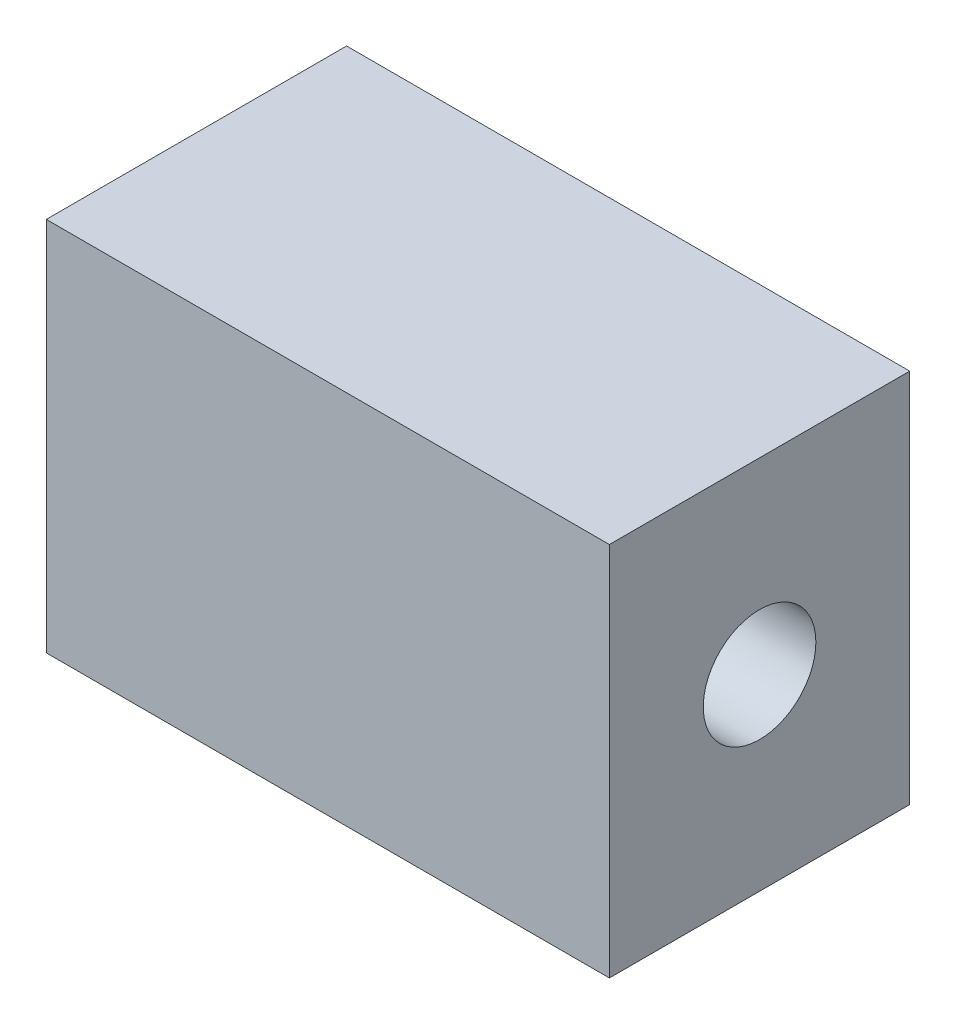
ISO-10303-21;
HEADER;
FILE_DESCRIPTION(('STEP AP214'),'2;1');
FILE_NAME('part.step','',(''),(''),'','','');
FILE_SCHEMA(('AUTOMOTIVE_DESIGN { 1 0 10303 214 1 1 1 1 }'));
ENDSEC;
DATA;
#1=APPLICATION_CONTEXT('core data for automotive mechanical design processes');
#2=APPLICATION_PROTOCOL_DEFINITION('international standard','automotive_design',2000,#1);
#3=PRODUCT_CONTEXT('',#1,'mechanical');
#4=PRODUCT('Part','Part','',(#3));
#5=PRODUCT_RELATED_PRODUCT_CATEGORY('part','',(#4));
#6=PRODUCT_DEFINITION_FORMATION('','',#4);
#7=PRODUCT_DEFINITION_CONTEXT('part definition',#1,'design');
#8=PRODUCT_DEFINITION('design','',#6,#7);
#9=PRODUCT_DEFINITION_SHAPE('','',#8);
#10=(LENGTH_UNIT() NAMED_UNIT(*) SI_UNIT(.MILLI.,.METRE.));
#11=(NAMED_UNIT(*) PLANE_ANGLE_UNIT() SI_UNIT($,.RADIAN.));
#12=(NAMED_UNIT(*) SI_UNIT($,.STERADIAN.) SOLID_ANGLE_UNIT());
#13=UNCERTAINTY_MEASURE_WITH_UNIT(LENGTH_MEASURE(1.E-05),#10,'distance_accuracy_value','');
#14=(GEOMETRIC_REPRESENTATION_CONTEXT(3) GLOBAL_UNCERTAINTY_ASSIGNED_CONTEXT((#13)) GLOBAL_UNIT_ASSIGNED_CONTEXT((#10,
#11,#12)) REPRESENTATION_CONTEXT('',''));
#15=CARTESIAN_POINT('',(0.,0.,0.));
#16=DIRECTION('',(0.,0.,1.));
#17=DIRECTION('',(1.,0.,0.));
#18=AXIS2_PLACEMENT_3D('',#15,#16,#17);
#19=CARTESIAN_POINT('',(-11.6375545851528,-0.502183406113536,8.));
#20=DIRECTION('',(0.,1.,0.));
#21=DIRECTION('',(0.,0.,1.));
#22=AXIS2_PLACEMENT_3D('',#19,#20,#21);
#23=PLANE('',#22);
#24=DIRECTION('',(1.,0.,0.));
#25=VECTOR('',#24,1.);
#26=CARTESIAN_POINT('',(-11.6375545851528,-0.502183406113536,0.));
#27=LINE('',#26,#25);
#28=CARTESIAN_POINT('',(-11.6375545851528,-0.502183406113536,0.));
#29=VERTEX_POINT('',#28);
#30=CARTESIAN_POINT('',(3.36244541484716,-0.502183406113536,0.));
#31=VERTEX_POINT('',#30);
#32=EDGE_CURVE('E97',#29,#31,#27,.T.);
#33=ORIENTED_EDGE('',*,*,#32,.T.);
#34=DIRECTION('',(0.,0.,-1.));
#35=VECTOR('',#34,1.);
#36=CARTESIAN_POINT('',(3.36244541484716,-0.502183406113536,8.));
#37=LINE('',#36,#35);
#38=CARTESIAN_POINT('',(3.36244541484716,-0.502183406113536,8.));
#39=VERTEX_POINT('',#38);
#40=EDGE_CURVE('E11',#39,#31,#37,.T.);
#41=ORIENTED_EDGE('',*,*,#40,.F.);
#42=DIRECTION('',(1.,0.,0.));
#43=VECTOR('',#42,1.);
#44=CARTESIAN_POINT('',(-11.6375545851528,-0.502183406113536,8.));
#45=LINE('',#44,#43);
#46=CARTESIAN_POINT('',(-11.6375545851528,-0.502183406113536,8.));
#47=VERTEX_POINT('',#46);
#48=EDGE_CURVE('E74',#47,#39,#45,.T.);
#49=ORIENTED_EDGE('',*,*,#48,.F.);
#50=DIRECTION('',(0.,0.,-1.));
#51=VECTOR('',#50,1.);
#52=CARTESIAN_POINT('',(-11.6375545851528,-0.502183406113536,8.));
#53=LINE('',#52,#51);
#54=EDGE_CURVE('E93',#47,#29,#53,.T.);
#55=ORIENTED_EDGE('',*,*,#54,.T.);
#56=EDGE_LOOP('',(#33,#41,#49,#55));
#57=FACE_BOUND('',#56,.T.);
#58=ADVANCED_FACE('F35',(#57),#23,.F.);
#59=CARTESIAN_POINT('',(3.36244541484716,9.49781659388646,8.));
#60=DIRECTION('',(1.,0.,0.));
#61=DIRECTION('',(0.,0.,-1.));
#62=AXIS2_PLACEMENT_3D('',#59,#60,#61);
#63=PLANE('',#62);
#64=CARTESIAN_POINT('',(3.36244541484716,4.49781659388646,4.));
#65=DIRECTION('',(1.,0.,0.));
#66=DIRECTION('',(0.,0.,-1.));
#67=AXIS2_PLACEMENT_3D('',#64,#65,#66);
#68=CIRCLE('',#67,1.5);
#69=CARTESIAN_POINT('',(3.36244541484716,4.49781659388646,2.5));
#70=VERTEX_POINT('',#69);
#71=EDGE_CURVE('E138',#70,#70,#68,.T.);
#72=ORIENTED_EDGE('',*,*,#71,.F.);
#73=EDGE_LOOP('',(#72));
#74=FACE_BOUND('',#73,.T.);
#75=DIRECTION('',(0.,-1.,0.));
#76=VECTOR('',#75,1.);
#77=CARTESIAN_POINT('',(3.36244541484716,9.49781659388646,0.));
#78=LINE('',#77,#76);
#79=CARTESIAN_POINT('',(3.36244541484716,9.49781659388646,0.));
#80=VERTEX_POINT('',#79);
#81=EDGE_CURVE('E83',#80,#31,#78,.T.);
#82=ORIENTED_EDGE('',*,*,#81,.F.);
#83=DIRECTION('',(0.,0.,-1.));
#84=VECTOR('',#83,1.);
#85=CARTESIAN_POINT('',(3.36244541484716,9.49781659388646,8.));
#86=LINE('',#85,#84);
#87=CARTESIAN_POINT('',(3.36244541484716,9.49781659388646,8.));
#88=VERTEX_POINT('',#87);
#89=EDGE_CURVE('E43',#88,#80,#86,.T.);
#90=ORIENTED_EDGE('',*,*,#89,.F.);
#91=DIRECTION('',(0.,-1.,0.));
#92=VECTOR('',#91,1.);
#93=CARTESIAN_POINT('',(3.36244541484716,9.49781659388646,8.));
#94=LINE('',#93,#92);
#95=EDGE_CURVE('E81',#88,#39,#94,.T.);
#96=ORIENTED_EDGE('',*,*,#95,.T.);
#97=ORIENTED_EDGE('',*,*,#40,.T.);
#98=EDGE_LOOP('',(#82,#90,#96,#97));
#99=FACE_BOUND('',#98,.T.);
#100=ADVANCED_FACE('F80',(#74,#99),#63,.T.);
#101=CARTESIAN_POINT('',(-11.6375545851528,9.49781659388646,8.));
#102=DIRECTION('',(0.,1.,0.));
#103=DIRECTION('',(0.,0.,1.));
#104=AXIS2_PLACEMENT_3D('',#101,#102,#103);
#105=PLANE('',#104);
#106=DIRECTION('',(1.,0.,0.));
#107=VECTOR('',#106,1.);
#108=CARTESIAN_POINT('',(-11.6375545851528,9.49781659388646,0.));
#109=LINE('',#108,#107);
#110=CARTESIAN_POINT('',(-11.6375545851528,9.49781659388646,0.));
#111=VERTEX_POINT('',#110);
#112=EDGE_CURVE('E102',#111,#80,#109,.T.);
#113=ORIENTED_EDGE('',*,*,#112,.F.);
#114=DIRECTION('',(0.,0.,-1.));
#115=VECTOR('',#114,1.);
#116=CARTESIAN_POINT('',(-11.6375545851528,9.49781659388646,8.));
#117=LINE('',#116,#115);
#118=CARTESIAN_POINT('',(-11.6375545851528,9.49781659388646,8.));
#119=VERTEX_POINT('',#118);
#120=EDGE_CURVE('E66',#119,#111,#117,.T.);
#121=ORIENTED_EDGE('',*,*,#120,.F.);
#122=DIRECTION('',(1.,0.,0.));
#123=VECTOR('',#122,1.);
#124=CARTESIAN_POINT('',(-11.6375545851528,9.49781659388646,8.));
#125=LINE('',#124,#123);
#126=EDGE_CURVE('E89',#119,#88,#125,.T.);
#127=ORIENTED_EDGE('',*,*,#126,.T.);
#128=ORIENTED_EDGE('',*,*,#89,.T.);
#129=EDGE_LOOP('',(#113,#121,#127,#128));
#130=FACE_BOUND('',#129,.T.);
#131=ADVANCED_FACE('F91',(#130),#105,.T.);
#132=CARTESIAN_POINT('',(-11.6375545851528,9.49781659388646,8.));
#133=DIRECTION('',(1.,0.,0.));
#134=DIRECTION('',(0.,0.,-1.));
#135=AXIS2_PLACEMENT_3D('',#132,#133,#134);
#136=PLANE('',#135);
#137=CARTESIAN_POINT('',(-11.6375545851528,4.49781659388646,4.));
#138=DIRECTION('',(1.,0.,0.));
#139=DIRECTION('',(0.,0.,-1.));
#140=AXIS2_PLACEMENT_3D('',#137,#138,#139);
#141=CIRCLE('',#140,1.5);
#142=CARTESIAN_POINT('',(-11.6375545851528,4.49781659388646,2.5));
#143=VERTEX_POINT('',#142);
#144=EDGE_CURVE('E100',#143,#143,#141,.T.);
#145=ORIENTED_EDGE('',*,*,#144,.T.);
#146=EDGE_LOOP('',(#145));
#147=FACE_BOUND('',#146,.T.);
#148=DIRECTION('',(0.,-1.,0.));
#149=VECTOR('',#148,1.);
#150=CARTESIAN_POINT('',(-11.6375545851528,9.49781659388646,0.));
#151=LINE('',#150,#149);
#152=EDGE_CURVE('E69',#111,#29,#151,.T.);
#153=ORIENTED_EDGE('',*,*,#152,.T.);
#154=ORIENTED_EDGE('',*,*,#54,.F.);
#155=DIRECTION('',(0.,-1.,0.));
#156=VECTOR('',#155,1.);
#157=CARTESIAN_POINT('',(-11.6375545851528,9.49781659388646,8.));
#158=LINE('',#157,#156);
#159=EDGE_CURVE('E51',#119,#47,#158,.T.);
#160=ORIENTED_EDGE('',*,*,#159,.F.);
#161=ORIENTED_EDGE('',*,*,#120,.T.);
#162=EDGE_LOOP('',(#153,#154,#160,#161));
#163=FACE_BOUND('',#162,.T.);
#164=ADVANCED_FACE('F119',(#147,#163),#136,.F.);
#165=CARTESIAN_POINT('',(0.,0.,8.));
#166=DIRECTION('',(0.,0.,-1.));
#167=DIRECTION('',(-1.,0.,0.));
#168=AXIS2_PLACEMENT_3D('',#165,#166,#167);
#169=PLANE('',#168);
#170=ORIENTED_EDGE('',*,*,#48,.T.);
#171=ORIENTED_EDGE('',*,*,#95,.F.);
#172=ORIENTED_EDGE('',*,*,#126,.F.);
#173=ORIENTED_EDGE('',*,*,#159,.T.);
#174=EDGE_LOOP('',(#170,#171,#172,#173));
#175=FACE_BOUND('',#174,.T.);
#176=ADVANCED_FACE('F88',(#175),#169,.F.);
#177=CARTESIAN_POINT('',(0.,0.,0.));
#178=DIRECTION('',(0.,0.,-1.));
#179=DIRECTION('',(-1.,0.,0.));
#180=AXIS2_PLACEMENT_3D('',#177,#178,#179);
#181=PLANE('',#180);
#182=ORIENTED_EDGE('',*,*,#32,.F.);
#183=ORIENTED_EDGE('',*,*,#152,.F.);
#184=ORIENTED_EDGE('',*,*,#112,.T.);
#185=ORIENTED_EDGE('',*,*,#81,.T.);
#186=EDGE_LOOP('',(#182,#183,#184,#185));
#187=FACE_BOUND('',#186,.T.);
#188=ADVANCED_FACE('F109',(#187),#181,.T.);
#189=CARTESIAN_POINT('',(-11.6375545851528,4.49781659388646,4.));
#190=DIRECTION('',(1.,0.,0.));
#191=DIRECTION('',(0.,0.,-1.));
#192=AXIS2_PLACEMENT_3D('',#189,#190,#191);
#193=CYLINDRICAL_SURFACE('',#192,1.5);
#194=ORIENTED_EDGE('',*,*,#144,.F.);
#195=EDGE_LOOP('',(#194));
#196=FACE_BOUND('',#195,.T.);
#197=ORIENTED_EDGE('',*,*,#71,.T.);
#198=EDGE_LOOP('',(#197));
#199=FACE_BOUND('',#198,.T.);
#200=ADVANCED_FACE('F111',(#196,#199),#193,.F.);
#201=CLOSED_SHELL('',(#58,#100,#131,#164,#176,#188,#200));
#202=MANIFOLD_SOLID_BREP('B2',#201);
#203=ADVANCED_BREP_SHAPE_REPRESENTATION('',(#18,#202),#14);
#204=SHAPE_DEFINITION_REPRESENTATION(#9,#203);
ENDSEC;
END-ISO-10303-21;
